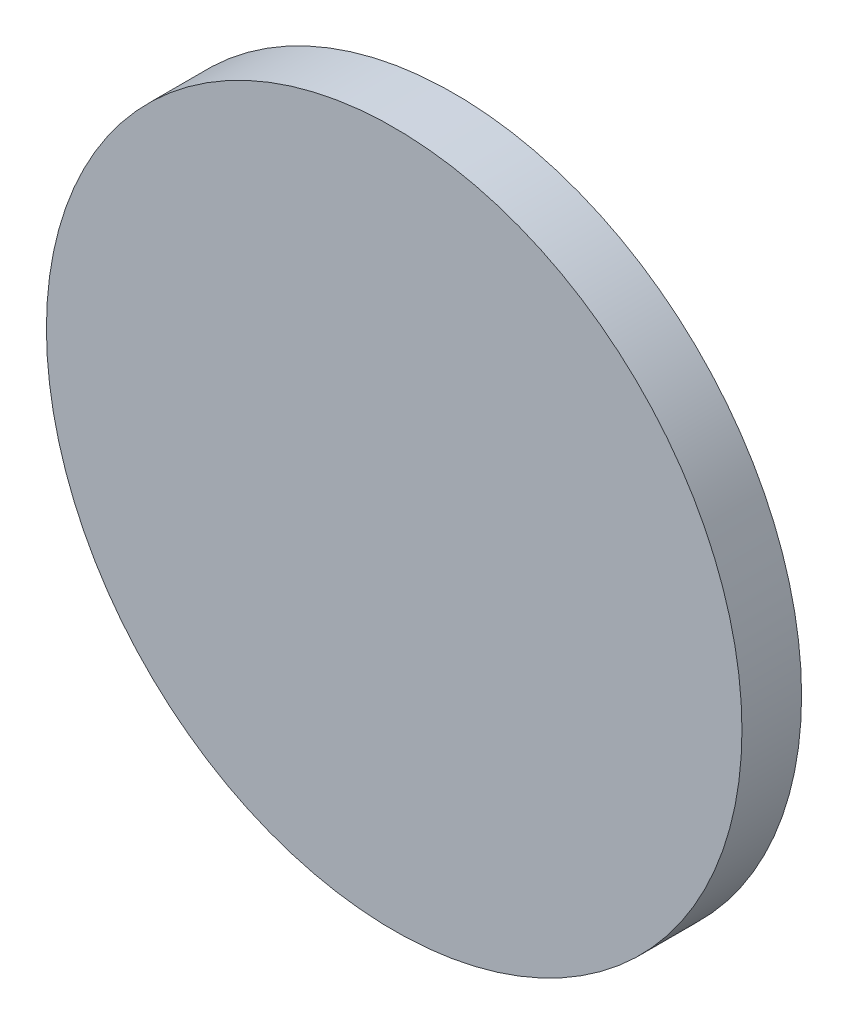
ISO-10303-21;
HEADER;
FILE_DESCRIPTION(('STEP AP214'),'2;1');
FILE_NAME('part.step','',(''),(''),'','','');
FILE_SCHEMA(('AUTOMOTIVE_DESIGN { 1 0 10303 214 1 1 1 1 }'));
ENDSEC;
DATA;
#1=APPLICATION_CONTEXT('core data for automotive mechanical design processes');
#2=APPLICATION_PROTOCOL_DEFINITION('international standard','automotive_design',2000,#1);
#3=PRODUCT_CONTEXT('',#1,'mechanical');
#4=PRODUCT('Part','Part','',(#3));
#5=PRODUCT_RELATED_PRODUCT_CATEGORY('part','',(#4));
#6=PRODUCT_DEFINITION_FORMATION('','',#4);
#7=PRODUCT_DEFINITION_CONTEXT('part definition',#1,'design');
#8=PRODUCT_DEFINITION('design','',#6,#7);
#9=PRODUCT_DEFINITION_SHAPE('','',#8);
#10=(LENGTH_UNIT() NAMED_UNIT(*) SI_UNIT(.MILLI.,.METRE.));
#11=(NAMED_UNIT(*) PLANE_ANGLE_UNIT() SI_UNIT($,.RADIAN.));
#12=(NAMED_UNIT(*) SI_UNIT($,.STERADIAN.) SOLID_ANGLE_UNIT());
#13=UNCERTAINTY_MEASURE_WITH_UNIT(LENGTH_MEASURE(1.E-05),#10,'distance_accuracy_value','');
#14=(GEOMETRIC_REPRESENTATION_CONTEXT(3) GLOBAL_UNCERTAINTY_ASSIGNED_CONTEXT((#13)) GLOBAL_UNIT_ASSIGNED_CONTEXT((#10,
#11,#12)) REPRESENTATION_CONTEXT('',''));
#15=CARTESIAN_POINT('',(0.,0.,0.));
#16=DIRECTION('',(0.,0.,1.));
#17=DIRECTION('',(1.,0.,0.));
#18=AXIS2_PLACEMENT_3D('',#15,#16,#17);
#19=CARTESIAN_POINT('',(3.0353,9.359900006176,0.));
#20=DIRECTION('',(0.,0.,-1.));
#21=DIRECTION('',(-1.,0.,0.));
#22=AXIS2_PLACEMENT_3D('',#19,#20,#21);
#23=PLANE('',#22);
#24=CARTESIAN_POINT('',(3.0353,9.359900006176,0.));
#25=DIRECTION('',(0.,0.,1.));
#26=DIRECTION('',(1.,0.,0.));
#27=AXIS2_PLACEMENT_3D('',#24,#25,#26);
#28=CIRCLE('',#27,0.200024667);
#29=CARTESIAN_POINT('',(3.235324667,9.359900006176,0.));
#30=VERTEX_POINT('',#29);
#31=EDGE_CURVE('E18',#30,#30,#28,.T.);
#32=ORIENTED_EDGE('',*,*,#31,.F.);
#33=EDGE_LOOP('',(#32));
#34=FACE_BOUND('',#33,.T.);
#35=ADVANCED_FACE('F15',(#34),#23,.T.);
#36=CARTESIAN_POINT('',(3.0353,9.359900006176,0.));
#37=DIRECTION('',(0.,0.,1.));
#38=DIRECTION('',(1.,0.,0.));
#39=AXIS2_PLACEMENT_3D('',#36,#37,#38);
#40=CYLINDRICAL_SURFACE('',#39,0.200024667);
#41=CARTESIAN_POINT('',(3.0353,9.359900006176,0.03429));
#42=DIRECTION('',(0.,0.,1.));
#43=DIRECTION('',(1.,0.,0.));
#44=AXIS2_PLACEMENT_3D('',#41,#42,#43);
#45=CIRCLE('',#44,0.200024667);
#46=CARTESIAN_POINT('',(3.235324667,9.359900006176,0.03429));
#47=VERTEX_POINT('',#46);
#48=EDGE_CURVE('E10',#47,#47,#45,.T.);
#49=ORIENTED_EDGE('',*,*,#48,.F.);
#50=EDGE_LOOP('',(#49));
#51=FACE_BOUND('',#50,.T.);
#52=ORIENTED_EDGE('',*,*,#31,.T.);
#53=EDGE_LOOP('',(#52));
#54=FACE_BOUND('',#53,.T.);
#55=ADVANCED_FACE('F27',(#51,#54),#40,.T.);
#56=CARTESIAN_POINT('',(3.0353,9.359900006176,0.03429));
#57=DIRECTION('',(0.,0.,1.));
#58=DIRECTION('',(1.,0.,0.));
#59=AXIS2_PLACEMENT_3D('',#56,#57,#58);
#60=PLANE('',#59);
#61=ORIENTED_EDGE('',*,*,#48,.T.);
#62=EDGE_LOOP('',(#61));
#63=FACE_BOUND('',#62,.T.);
#64=ADVANCED_FACE('F34',(#63),#60,.T.);
#65=CLOSED_SHELL('',(#35,#55,#64));
#66=MANIFOLD_SOLID_BREP('B1',#65);
#67=ADVANCED_BREP_SHAPE_REPRESENTATION('',(#18,#66),#14);
#68=SHAPE_DEFINITION_REPRESENTATION(#9,#67);
ENDSEC;
END-ISO-10303-21;
